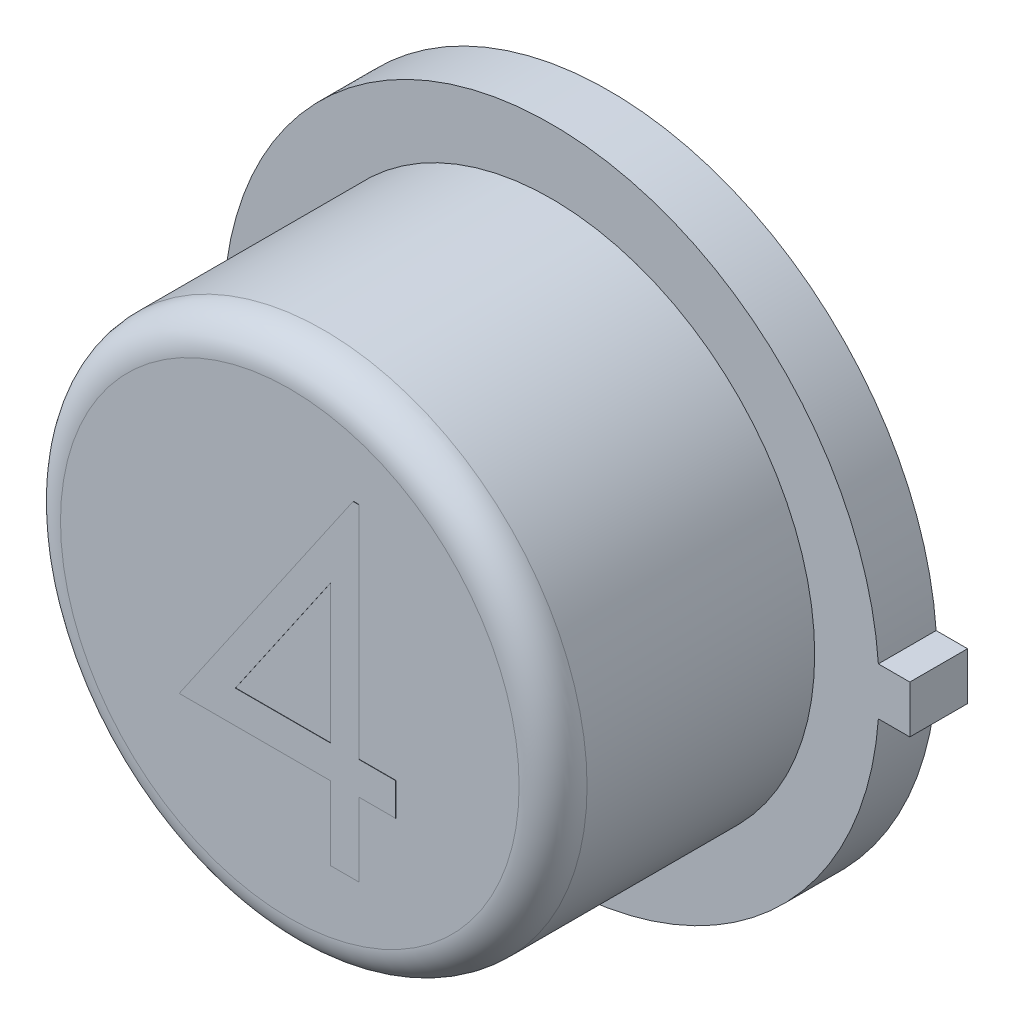
ISO-10303-21;
HEADER;
FILE_DESCRIPTION(('STEP AP214'),'2;1');
FILE_NAME('part.step','',(''),(''),'','','');
FILE_SCHEMA(('AUTOMOTIVE_DESIGN { 1 0 10303 214 1 1 1 1 }'));
ENDSEC;
DATA;
#1=APPLICATION_CONTEXT('core data for automotive mechanical design processes');
#2=APPLICATION_PROTOCOL_DEFINITION('international standard','automotive_design',2000,#1);
#3=PRODUCT_CONTEXT('',#1,'mechanical');
#4=PRODUCT('Part','Part','',(#3));
#5=PRODUCT_RELATED_PRODUCT_CATEGORY('part','',(#4));
#6=PRODUCT_DEFINITION_FORMATION('','',#4);
#7=PRODUCT_DEFINITION_CONTEXT('part definition',#1,'design');
#8=PRODUCT_DEFINITION('design','',#6,#7);
#9=PRODUCT_DEFINITION_SHAPE('','',#8);
#10=(LENGTH_UNIT() NAMED_UNIT(*) SI_UNIT(.MILLI.,.METRE.));
#11=(NAMED_UNIT(*) PLANE_ANGLE_UNIT() SI_UNIT($,.RADIAN.));
#12=(NAMED_UNIT(*) SI_UNIT($,.STERADIAN.) SOLID_ANGLE_UNIT());
#13=UNCERTAINTY_MEASURE_WITH_UNIT(LENGTH_MEASURE(1.E-05),#10,'distance_accuracy_value','');
#14=(GEOMETRIC_REPRESENTATION_CONTEXT(3) GLOBAL_UNCERTAINTY_ASSIGNED_CONTEXT((#13)) GLOBAL_UNIT_ASSIGNED_CONTEXT((#10,
#11,#12)) REPRESENTATION_CONTEXT('',''));
#15=CARTESIAN_POINT('',(0.,0.,0.));
#16=DIRECTION('',(0.,0.,1.));
#17=DIRECTION('',(1.,0.,0.));
#18=AXIS2_PLACEMENT_3D('',#15,#16,#17);
#19=CARTESIAN_POINT('',(0.,0.,2.3876));
#20=DIRECTION('',(0.,0.,1.));
#21=DIRECTION('',(1.,0.,0.));
#22=AXIS2_PLACEMENT_3D('',#19,#20,#21);
#23=PLANE('',#22);
#24=DIRECTION('',(0.566105543193208,0.824332768950697,0.));
#25=VECTOR('',#24,1.);
#26=CARTESIAN_POINT('',(-0.824278846153846,-0.6686219761522,2.3876));
#27=LINE('',#26,#25);
#28=CARTESIAN_POINT('',(-0.824278846153846,-0.6686219761522,2.3876));
#29=VERTEX_POINT('',#28);
#30=CARTESIAN_POINT('',(0.475582181490385,1.22416648538626,2.3876));
#31=VERTEX_POINT('',#30);
#32=EDGE_CURVE('E171',#29,#31,#27,.T.);
#33=ORIENTED_EDGE('',*,*,#32,.T.);
#34=DIRECTION('',(1.,0.,0.));
#35=VECTOR('',#34,1.);
#36=CARTESIAN_POINT('',(0.475582181490385,1.22416648538626,2.3876));
#37=LINE('',#36,#35);
#38=CARTESIAN_POINT('',(0.518990384615385,1.22416648538626,2.3876));
#39=VERTEX_POINT('',#38);
#40=EDGE_CURVE('E217',#31,#39,#37,.T.);
#41=ORIENTED_EDGE('',*,*,#40,.T.);
#42=DIRECTION('',(0.,-1.,0.));
#43=VECTOR('',#42,1.);
#44=CARTESIAN_POINT('',(0.518990384615385,1.22416648538626,2.3876));
#45=LINE('',#44,#43);
#46=CARTESIAN_POINT('',(0.518990384615385,-0.424391206921431,2.3876));
#47=VERTEX_POINT('',#46);
#48=EDGE_CURVE('E219',#39,#47,#45,.T.);
#49=ORIENTED_EDGE('',*,*,#48,.T.);
#50=DIRECTION('',(1.,0.,0.));
#51=VECTOR('',#50,1.);
#52=CARTESIAN_POINT('',(0.518990384615385,-0.424391206921431,2.3876));
#53=LINE('',#52,#51);
#54=CARTESIAN_POINT('',(0.79375,-0.424391206921431,2.3876));
#55=VERTEX_POINT('',#54);
#56=EDGE_CURVE('E221',#47,#55,#53,.T.);
#57=ORIENTED_EDGE('',*,*,#56,.T.);
#58=DIRECTION('',(0.,-1.,0.));
#59=VECTOR('',#58,1.);
#60=CARTESIAN_POINT('',(0.79375,-0.424391206921431,2.3876));
#61=LINE('',#60,#59);
#62=CARTESIAN_POINT('',(0.79375,-0.6686219761522,2.3876));
#63=VERTEX_POINT('',#62);
#64=EDGE_CURVE('E223',#55,#63,#61,.T.);
#65=ORIENTED_EDGE('',*,*,#64,.T.);
#66=DIRECTION('',(-1.,0.,0.));
#67=VECTOR('',#66,1.);
#68=CARTESIAN_POINT('',(0.79375,-0.6686219761522,2.3876));
#69=LINE('',#68,#67);
#70=CARTESIAN_POINT('',(0.518990384615385,-0.6686219761522,2.3876));
#71=VERTEX_POINT('',#70);
#72=EDGE_CURVE('E225',#63,#71,#69,.T.);
#73=ORIENTED_EDGE('',*,*,#72,.T.);
#74=DIRECTION('',(0.,-1.,0.));
#75=VECTOR('',#74,1.);
#76=CARTESIAN_POINT('',(0.518990384615385,-0.6686219761522,2.3876));
#77=LINE('',#76,#75);
#78=CARTESIAN_POINT('',(0.518990384615385,-1.21814120692143,2.3876));
#79=VERTEX_POINT('',#78);
#80=EDGE_CURVE('E227',#71,#79,#77,.T.);
#81=ORIENTED_EDGE('',*,*,#80,.T.);
#82=DIRECTION('',(-1.,0.,0.));
#83=VECTOR('',#82,1.);
#84=CARTESIAN_POINT('',(0.518990384615385,-1.21814120692143,2.3876));
#85=LINE('',#84,#83);
#86=CARTESIAN_POINT('',(0.305288461538462,-1.21814120692143,2.3876));
#87=VERTEX_POINT('',#86);
#88=EDGE_CURVE('E229',#79,#87,#85,.T.);
#89=ORIENTED_EDGE('',*,*,#88,.T.);
#90=DIRECTION('',(0.,1.,0.));
#91=VECTOR('',#90,1.);
#92=CARTESIAN_POINT('',(0.305288461538462,-1.21814120692143,2.3876));
#93=LINE('',#92,#91);
#94=CARTESIAN_POINT('',(0.305288461538462,-0.6686219761522,2.3876));
#95=VERTEX_POINT('',#94);
#96=EDGE_CURVE('E53',#87,#95,#93,.T.);
#97=ORIENTED_EDGE('',*,*,#96,.T.);
#98=DIRECTION('',(-1.,0.,0.));
#99=VECTOR('',#98,1.);
#100=CARTESIAN_POINT('',(0.305288461538462,-0.6686219761522,2.3876));
#101=LINE('',#100,#99);
#102=EDGE_CURVE('E48',#95,#29,#101,.T.);
#103=ORIENTED_EDGE('',*,*,#102,.T.);
#104=EDGE_LOOP('',(#33,#41,#49,#57,#65,#73,#81,#89,#97,#103));
#105=FACE_BOUND('',#104,.T.);
#106=CARTESIAN_POINT('',(0.,0.,2.3876));
#107=DIRECTION('',(0.,0.,1.));
#108=DIRECTION('',(1.,0.,0.));
#109=AXIS2_PLACEMENT_3D('',#106,#107,#108);
#110=CIRCLE('',#109,1.7145);
#111=CARTESIAN_POINT('',(1.7145,0.,2.3876));
#112=VERTEX_POINT('',#111);
#113=EDGE_CURVE('E41',#112,#112,#110,.T.);
#114=ORIENTED_EDGE('',*,*,#113,.T.);
#115=EDGE_LOOP('',(#114));
#116=FACE_BOUND('',#115,.T.);
#117=ADVANCED_FACE('F33',(#105,#116),#23,.T.);
#118=CARTESIAN_POINT('',(-0.00322860507148085,-5.53029106093277,0.));
#119=DIRECTION('',(0.,0.,1.));
#120=DIRECTION('',(1.,0.,0.));
#121=AXIS2_PLACEMENT_3D('',#118,#119,#120);
#122=PLANE('',#121);
#123=DIRECTION('',(1.,0.,0.));
#124=VECTOR('',#123,1.);
#125=CARTESIAN_POINT('',(-0.0032286050714822,0.177799999999999,0.));
#126=LINE('',#125,#124);
#127=CARTESIAN_POINT('',(2.44464278985704,0.177799999999999,0.));
#128=VERTEX_POINT('',#127);
#129=CARTESIAN_POINT('',(2.6797,0.177799999999999,0.));
#130=VERTEX_POINT('',#129);
#131=EDGE_CURVE('E266',#128,#130,#126,.T.);
#132=ORIENTED_EDGE('',*,*,#131,.T.);
#133=DIRECTION('',(0.,-1.,0.));
#134=VECTOR('',#133,1.);
#135=CARTESIAN_POINT('',(2.6797,-5.53029106093277,0.));
#136=LINE('',#135,#134);
#137=CARTESIAN_POINT('',(2.6797,-0.1778,0.));
#138=VERTEX_POINT('',#137);
#139=EDGE_CURVE('E271',#130,#138,#136,.T.);
#140=ORIENTED_EDGE('',*,*,#139,.T.);
#141=DIRECTION('',(-1.,0.,0.));
#142=VECTOR('',#141,1.);
#143=CARTESIAN_POINT('',(-0.00322860507148085,-0.1778,0.));
#144=LINE('',#143,#142);
#145=CARTESIAN_POINT('',(2.44464278985704,-0.1778,0.));
#146=VERTEX_POINT('',#145);
#147=EDGE_CURVE('E285',#138,#146,#144,.T.);
#148=ORIENTED_EDGE('',*,*,#147,.T.);
#149=CARTESIAN_POINT('',(0.,0.,0.));
#150=DIRECTION('',(0.,0.,1.));
#151=DIRECTION('',(1.,0.,0.));
#152=AXIS2_PLACEMENT_3D('',#149,#150,#151);
#153=CIRCLE('',#152,2.4511);
#154=EDGE_CURVE('E282',#128,#146,#153,.T.);
#155=ORIENTED_EDGE('',*,*,#154,.F.);
#156=EDGE_LOOP('',(#132,#140,#148,#155));
#157=FACE_BOUND('',#156,.T.);
#158=CARTESIAN_POINT('',(0.,0.,0.));
#159=DIRECTION('',(0.,0.,1.));
#160=DIRECTION('',(1.,0.,0.));
#161=AXIS2_PLACEMENT_3D('',#158,#159,#160);
#162=CIRCLE('',#161,1.75756648099992);
#163=CARTESIAN_POINT('',(1.75756648099992,0.,0.));
#164=VERTEX_POINT('',#163);
#165=EDGE_CURVE('E297',#164,#164,#162,.F.);
#166=ORIENTED_EDGE('',*,*,#165,.F.);
#167=EDGE_LOOP('',(#166));
#168=FACE_BOUND('',#167,.T.);
#169=ADVANCED_FACE('F318',(#157,#168),#122,.F.);
#170=CARTESIAN_POINT('',(-0.00322860507148085,-5.53029106093277,0.4318));
#171=DIRECTION('',(0.,0.,1.));
#172=DIRECTION('',(1.,0.,0.));
#173=AXIS2_PLACEMENT_3D('',#170,#171,#172);
#174=PLANE('',#173);
#175=DIRECTION('',(1.,0.,0.));
#176=VECTOR('',#175,1.);
#177=CARTESIAN_POINT('',(-0.0032286050714822,0.177799999999999,0.4318));
#178=LINE('',#177,#176);
#179=CARTESIAN_POINT('',(2.44464278985704,0.177799999999999,0.4318));
#180=VERTEX_POINT('',#179);
#181=CARTESIAN_POINT('',(2.6797,0.177799999999999,0.4318));
#182=VERTEX_POINT('',#181);
#183=EDGE_CURVE('E267',#180,#182,#178,.T.);
#184=ORIENTED_EDGE('',*,*,#183,.F.);
#185=CARTESIAN_POINT('',(0.,0.,0.4318));
#186=DIRECTION('',(0.,0.,1.));
#187=DIRECTION('',(1.,0.,0.));
#188=AXIS2_PLACEMENT_3D('',#185,#186,#187);
#189=CIRCLE('',#188,2.4511);
#190=CARTESIAN_POINT('',(2.44464278985704,-0.1778,0.4318));
#191=VERTEX_POINT('',#190);
#192=EDGE_CURVE('E270',#180,#191,#189,.T.);
#193=ORIENTED_EDGE('',*,*,#192,.T.);
#194=DIRECTION('',(-1.,0.,0.));
#195=VECTOR('',#194,1.);
#196=CARTESIAN_POINT('',(-0.00322860507148085,-0.1778,0.4318));
#197=LINE('',#196,#195);
#198=CARTESIAN_POINT('',(2.6797,-0.1778,0.4318));
#199=VERTEX_POINT('',#198);
#200=EDGE_CURVE('E273',#199,#191,#197,.T.);
#201=ORIENTED_EDGE('',*,*,#200,.F.);
#202=DIRECTION('',(0.,-1.,0.));
#203=VECTOR('',#202,1.);
#204=CARTESIAN_POINT('',(2.6797,-5.53029106093277,0.4318));
#205=LINE('',#204,#203);
#206=EDGE_CURVE('E276',#182,#199,#205,.T.);
#207=ORIENTED_EDGE('',*,*,#206,.F.);
#208=EDGE_LOOP('',(#184,#193,#201,#207));
#209=FACE_BOUND('',#208,.T.);
#210=CARTESIAN_POINT('',(0.,0.,0.4318));
#211=DIRECTION('',(0.,0.,1.));
#212=DIRECTION('',(1.,0.,0.));
#213=AXIS2_PLACEMENT_3D('',#210,#211,#212);
#214=CIRCLE('',#213,1.9685);
#215=CARTESIAN_POINT('',(1.9685,0.,0.4318));
#216=VERTEX_POINT('',#215);
#217=EDGE_CURVE('E263',#216,#216,#214,.T.);
#218=ORIENTED_EDGE('',*,*,#217,.F.);
#219=EDGE_LOOP('',(#218));
#220=FACE_BOUND('',#219,.T.);
#221=ADVANCED_FACE('F324',(#209,#220),#174,.T.);
#222=CARTESIAN_POINT('',(-0.0032286050714822,0.177799999999999,0.4318));
#223=DIRECTION('',(0.,1.,0.));
#224=DIRECTION('',(-1.,0.,0.));
#225=AXIS2_PLACEMENT_3D('',#222,#223,#224);
#226=PLANE('',#225);
#227=ORIENTED_EDGE('',*,*,#131,.F.);
#228=DIRECTION('',(0.,0.,-1.));
#229=VECTOR('',#228,1.);
#230=CARTESIAN_POINT('',(2.44464278985704,0.177799999999999,0.4318));
#231=LINE('',#230,#229);
#232=EDGE_CURVE('E295',#180,#128,#231,.T.);
#233=ORIENTED_EDGE('',*,*,#232,.F.);
#234=ORIENTED_EDGE('',*,*,#183,.T.);
#235=DIRECTION('',(0.,0.,-1.));
#236=VECTOR('',#235,1.);
#237=CARTESIAN_POINT('',(2.6797,0.177799999999999,0.4318));
#238=LINE('',#237,#236);
#239=EDGE_CURVE('E279',#182,#130,#238,.T.);
#240=ORIENTED_EDGE('',*,*,#239,.T.);
#241=EDGE_LOOP('',(#227,#233,#234,#240));
#242=FACE_BOUND('',#241,.T.);
#243=ADVANCED_FACE('F404',(#242),#226,.T.);
#244=CARTESIAN_POINT('',(0.,0.,0.4318));
#245=DIRECTION('',(0.,0.,-1.));
#246=DIRECTION('',(-1.,0.,0.));
#247=AXIS2_PLACEMENT_3D('',#244,#245,#246);
#248=CYLINDRICAL_SURFACE('',#247,2.4511);
#249=ORIENTED_EDGE('',*,*,#154,.T.);
#250=DIRECTION('',(0.,0.,-1.));
#251=VECTOR('',#250,1.);
#252=CARTESIAN_POINT('',(2.44464278985704,-0.1778,0.4318));
#253=LINE('',#252,#251);
#254=EDGE_CURVE('E293',#191,#146,#253,.T.);
#255=ORIENTED_EDGE('',*,*,#254,.F.);
#256=ORIENTED_EDGE('',*,*,#192,.F.);
#257=ORIENTED_EDGE('',*,*,#232,.T.);
#258=EDGE_LOOP('',(#249,#255,#256,#257));
#259=FACE_BOUND('',#258,.T.);
#260=ADVANCED_FACE('F409',(#259),#248,.T.);
#261=CARTESIAN_POINT('',(-0.00322860507148085,-0.1778,0.4318));
#262=DIRECTION('',(0.,-1.,0.));
#263=DIRECTION('',(0.,0.,-1.));
#264=AXIS2_PLACEMENT_3D('',#261,#262,#263);
#265=PLANE('',#264);
#266=ORIENTED_EDGE('',*,*,#147,.F.);
#267=DIRECTION('',(0.,0.,-1.));
#268=VECTOR('',#267,1.);
#269=CARTESIAN_POINT('',(2.6797,-0.1778,0.4318));
#270=LINE('',#269,#268);
#271=EDGE_CURVE('E291',#199,#138,#270,.T.);
#272=ORIENTED_EDGE('',*,*,#271,.F.);
#273=ORIENTED_EDGE('',*,*,#200,.T.);
#274=ORIENTED_EDGE('',*,*,#254,.T.);
#275=EDGE_LOOP('',(#266,#272,#273,#274));
#276=FACE_BOUND('',#275,.T.);
#277=ADVANCED_FACE('F398',(#276),#265,.T.);
#278=CARTESIAN_POINT('',(2.6797,-5.53029106093277,0.4318));
#279=DIRECTION('',(1.,0.,0.));
#280=DIRECTION('',(0.,0.,-1.));
#281=AXIS2_PLACEMENT_3D('',#278,#279,#280);
#282=PLANE('',#281);
#283=ORIENTED_EDGE('',*,*,#139,.F.);
#284=ORIENTED_EDGE('',*,*,#239,.F.);
#285=ORIENTED_EDGE('',*,*,#206,.T.);
#286=ORIENTED_EDGE('',*,*,#271,.T.);
#287=EDGE_LOOP('',(#283,#284,#285,#286));
#288=FACE_BOUND('',#287,.T.);
#289=ADVANCED_FACE('F389',(#288),#282,.T.);
#290=CARTESIAN_POINT('',(0.,0.,2.3876));
#291=DIRECTION('',(0.,0.,-1.));
#292=DIRECTION('',(-1.,0.,0.));
#293=AXIS2_PLACEMENT_3D('',#290,#291,#292);
#294=CYLINDRICAL_SURFACE('',#293,1.9685);
#295=CARTESIAN_POINT('',(0.,0.,2.1336));
#296=DIRECTION('',(0.,0.,1.));
#297=DIRECTION('',(1.,0.,0.));
#298=AXIS2_PLACEMENT_3D('',#295,#296,#297);
#299=CIRCLE('',#298,1.9685);
#300=CARTESIAN_POINT('',(1.9685,0.,2.1336));
#301=VERTEX_POINT('',#300);
#302=EDGE_CURVE('E11',#301,#301,#299,.F.);
#303=ORIENTED_EDGE('',*,*,#302,.T.);
#304=EDGE_LOOP('',(#303));
#305=FACE_BOUND('',#304,.T.);
#306=ORIENTED_EDGE('',*,*,#217,.T.);
#307=EDGE_LOOP('',(#306));
#308=FACE_BOUND('',#307,.T.);
#309=ADVANCED_FACE('F384',(#305,#308),#294,.T.);
#310=CARTESIAN_POINT('',(0.,0.,-0.00254));
#311=DIRECTION('',(0.,0.,1.));
#312=DIRECTION('',(1.,0.,0.));
#313=AXIS2_PLACEMENT_3D('',#310,#311,#312);
#314=CYLINDRICAL_SURFACE('',#313,1.75756648099992);
#315=CARTESIAN_POINT('',(0.,0.,-0.00254));
#316=DIRECTION('',(0.,0.,-1.));
#317=DIRECTION('',(-1.,0.,0.));
#318=AXIS2_PLACEMENT_3D('',#315,#316,#317);
#319=CIRCLE('',#318,1.75756648099992);
#320=CARTESIAN_POINT('',(-1.75756648099992,0.,-0.00254));
#321=VERTEX_POINT('',#320);
#322=EDGE_CURVE('E235',#321,#321,#319,.T.);
#323=ORIENTED_EDGE('',*,*,#322,.F.);
#324=EDGE_LOOP('',(#323));
#325=FACE_BOUND('',#324,.T.);
#326=ORIENTED_EDGE('',*,*,#165,.T.);
#327=EDGE_LOOP('',(#326));
#328=FACE_BOUND('',#327,.T.);
#329=ADVANCED_FACE('F313',(#325,#328),#314,.T.);
#330=CARTESIAN_POINT('',(0.,0.,-0.00254));
#331=DIRECTION('',(0.,0.,-1.));
#332=DIRECTION('',(-1.,0.,0.));
#333=AXIS2_PLACEMENT_3D('',#330,#331,#332);
#334=PLANE('',#333);
#335=ORIENTED_EDGE('',*,*,#322,.T.);
#336=EDGE_LOOP('',(#335));
#337=FACE_BOUND('',#336,.T.);
#338=ADVANCED_FACE('F304',(#337),#334,.T.);
#339=CARTESIAN_POINT('',(0.,0.,2.1336));
#340=DIRECTION('',(0.,0.,1.));
#341=DIRECTION('',(1.,0.,0.));
#342=AXIS2_PLACEMENT_3D('',#339,#340,#341);
#343=TOROIDAL_SURFACE('',#342,1.7145,0.254);
#344=ORIENTED_EDGE('',*,*,#302,.F.);
#345=EDGE_LOOP('',(#344));
#346=FACE_BOUND('',#345,.T.);
#347=ORIENTED_EDGE('',*,*,#113,.F.);
#348=EDGE_LOOP('',(#347));
#349=FACE_BOUND('',#348,.T.);
#350=ADVANCED_FACE('F35',(#346,#349),#343,.T.);
#351=CARTESIAN_POINT('',(0.475582181490385,1.22416648538626,2.39014));
#352=DIRECTION('',(0.,0.,-1.));
#353=DIRECTION('',(-1.,0.,0.));
#354=AXIS2_PLACEMENT_3D('',#351,#352,#353);
#355=PLANE('',#354);
#356=DIRECTION('',(0.566105543193208,0.824332768950697,0.));
#357=VECTOR('',#356,1.);
#358=CARTESIAN_POINT('',(-0.824278846153846,-0.6686219761522,2.39014));
#359=LINE('',#358,#357);
#360=CARTESIAN_POINT('',(-0.824278846153846,-0.6686219761522,2.39014));
#361=VERTEX_POINT('',#360);
#362=CARTESIAN_POINT('',(0.475582181490385,1.22416648538626,2.39014));
#363=VERTEX_POINT('',#362);
#364=EDGE_CURVE('E185',#361,#363,#359,.T.);
#365=ORIENTED_EDGE('',*,*,#364,.F.);
#366=DIRECTION('',(-1.,0.,0.));
#367=VECTOR('',#366,1.);
#368=CARTESIAN_POINT('',(0.305288461538462,-0.6686219761522,2.39014));
#369=LINE('',#368,#367);
#370=CARTESIAN_POINT('',(0.305288461538462,-0.6686219761522,2.39014));
#371=VERTEX_POINT('',#370);
#372=EDGE_CURVE('E212',#371,#361,#369,.T.);
#373=ORIENTED_EDGE('',*,*,#372,.F.);
#374=DIRECTION('',(0.,1.,0.));
#375=VECTOR('',#374,1.);
#376=CARTESIAN_POINT('',(0.305288461538462,-1.21814120692143,2.39014));
#377=LINE('',#376,#375);
#378=CARTESIAN_POINT('',(0.305288461538462,-1.21814120692143,2.39014));
#379=VERTEX_POINT('',#378);
#380=EDGE_CURVE('E209',#379,#371,#377,.T.);
#381=ORIENTED_EDGE('',*,*,#380,.F.);
#382=DIRECTION('',(-1.,0.,0.));
#383=VECTOR('',#382,1.);
#384=CARTESIAN_POINT('',(0.518990384615385,-1.21814120692143,2.39014));
#385=LINE('',#384,#383);
#386=CARTESIAN_POINT('',(0.518990384615385,-1.21814120692143,2.39014));
#387=VERTEX_POINT('',#386);
#388=EDGE_CURVE('E206',#387,#379,#385,.T.);
#389=ORIENTED_EDGE('',*,*,#388,.F.);
#390=DIRECTION('',(0.,-1.,0.));
#391=VECTOR('',#390,1.);
#392=CARTESIAN_POINT('',(0.518990384615385,-0.6686219761522,2.39014));
#393=LINE('',#392,#391);
#394=CARTESIAN_POINT('',(0.518990384615385,-0.6686219761522,2.39014));
#395=VERTEX_POINT('',#394);
#396=EDGE_CURVE('E203',#395,#387,#393,.T.);
#397=ORIENTED_EDGE('',*,*,#396,.F.);
#398=DIRECTION('',(-1.,0.,0.));
#399=VECTOR('',#398,1.);
#400=CARTESIAN_POINT('',(0.79375,-0.6686219761522,2.39014));
#401=LINE('',#400,#399);
#402=CARTESIAN_POINT('',(0.79375,-0.6686219761522,2.39014));
#403=VERTEX_POINT('',#402);
#404=EDGE_CURVE('E200',#403,#395,#401,.T.);
#405=ORIENTED_EDGE('',*,*,#404,.F.);
#406=DIRECTION('',(0.,-1.,0.));
#407=VECTOR('',#406,1.);
#408=CARTESIAN_POINT('',(0.79375,-0.424391206921431,2.39014));
#409=LINE('',#408,#407);
#410=CARTESIAN_POINT('',(0.79375,-0.424391206921431,2.39014));
#411=VERTEX_POINT('',#410);
#412=EDGE_CURVE('E197',#411,#403,#409,.T.);
#413=ORIENTED_EDGE('',*,*,#412,.F.);
#414=DIRECTION('',(1.,0.,0.));
#415=VECTOR('',#414,1.);
#416=CARTESIAN_POINT('',(0.518990384615385,-0.424391206921431,2.39014));
#417=LINE('',#416,#415);
#418=CARTESIAN_POINT('',(0.518990384615385,-0.424391206921431,2.39014));
#419=VERTEX_POINT('',#418);
#420=EDGE_CURVE('E194',#419,#411,#417,.T.);
#421=ORIENTED_EDGE('',*,*,#420,.F.);
#422=DIRECTION('',(0.,-1.,0.));
#423=VECTOR('',#422,1.);
#424=CARTESIAN_POINT('',(0.518990384615385,1.22416648538626,2.39014));
#425=LINE('',#424,#423);
#426=CARTESIAN_POINT('',(0.518990384615385,1.22416648538626,2.39014));
#427=VERTEX_POINT('',#426);
#428=EDGE_CURVE('E191',#427,#419,#425,.T.);
#429=ORIENTED_EDGE('',*,*,#428,.F.);
#430=DIRECTION('',(1.,0.,0.));
#431=VECTOR('',#430,1.);
#432=CARTESIAN_POINT('',(0.475582181490385,1.22416648538626,2.39014));
#433=LINE('',#432,#431);
#434=EDGE_CURVE('E188',#363,#427,#433,.T.);
#435=ORIENTED_EDGE('',*,*,#434,.F.);
#436=EDGE_LOOP('',(#365,#373,#381,#389,#397,#405,#413,#421,#429,#435));
#437=FACE_BOUND('',#436,.T.);
#438=DIRECTION('',(1.,0.,0.));
#439=VECTOR('',#438,1.);
#440=CARTESIAN_POINT('',(-0.404507211538461,-0.424391206921431,2.39014));
#441=LINE('',#440,#439);
#442=CARTESIAN_POINT('',(-0.404507211538461,-0.424391206921431,2.39014));
#443=VERTEX_POINT('',#442);
#444=CARTESIAN_POINT('',(0.305288461538462,-0.424391206921431,2.39014));
#445=VERTEX_POINT('',#444);
#446=EDGE_CURVE('E152',#443,#445,#441,.T.);
#447=ORIENTED_EDGE('',*,*,#446,.F.);
#448=DIRECTION('',(-0.565883050718714,-0.82448552013318,0.));
#449=VECTOR('',#448,1.);
#450=CARTESIAN_POINT('',(0.305288461538462,0.609773456540108,2.39014));
#451=LINE('',#450,#449);
#452=CARTESIAN_POINT('',(0.305288461538462,0.609773456540108,2.39014));
#453=VERTEX_POINT('',#452);
#454=EDGE_CURVE('E175',#453,#443,#451,.T.);
#455=ORIENTED_EDGE('',*,*,#454,.F.);
#456=DIRECTION('',(0.,1.,0.));
#457=VECTOR('',#456,1.);
#458=CARTESIAN_POINT('',(0.305288461538462,-0.424391206921431,2.39014));
#459=LINE('',#458,#457);
#460=EDGE_CURVE('E162',#445,#453,#459,.T.);
#461=ORIENTED_EDGE('',*,*,#460,.F.);
#462=EDGE_LOOP('',(#447,#455,#461));
#463=FACE_BOUND('',#462,.T.);
#464=ADVANCED_FACE('F174',(#437,#463),#355,.F.);
#465=CARTESIAN_POINT('',(-0.824278846153846,-0.6686219761522,2.39014));
#466=DIRECTION('',(-0.824332768950697,0.566105543193208,0.));
#467=DIRECTION('',(-0.566105543193208,-0.824332768950697,0.));
#468=AXIS2_PLACEMENT_3D('',#465,#466,#467);
#469=PLANE('',#468);
#470=ORIENTED_EDGE('',*,*,#32,.F.);
#471=DIRECTION('',(0.,0.,-1.));
#472=VECTOR('',#471,1.);
#473=CARTESIAN_POINT('',(-0.824278846153846,-0.6686219761522,2.39014));
#474=LINE('',#473,#472);
#475=EDGE_CURVE('E233',#361,#29,#474,.T.);
#476=ORIENTED_EDGE('',*,*,#475,.F.);
#477=ORIENTED_EDGE('',*,*,#364,.T.);
#478=DIRECTION('',(0.,0.,-1.));
#479=VECTOR('',#478,1.);
#480=CARTESIAN_POINT('',(0.475582181490385,1.22416648538626,2.39014));
#481=LINE('',#480,#479);
#482=EDGE_CURVE('E215',#363,#31,#481,.T.);
#483=ORIENTED_EDGE('',*,*,#482,.T.);
#484=EDGE_LOOP('',(#470,#476,#477,#483));
#485=FACE_BOUND('',#484,.T.);
#486=ADVANCED_FACE('F310',(#485),#469,.T.);
#487=CARTESIAN_POINT('',(0.305288461538462,-0.6686219761522,2.39014));
#488=DIRECTION('',(0.,-1.,0.));
#489=DIRECTION('',(0.,0.,-1.));
#490=AXIS2_PLACEMENT_3D('',#487,#488,#489);
#491=PLANE('',#490);
#492=ORIENTED_EDGE('',*,*,#102,.F.);
#493=DIRECTION('',(0.,0.,-1.));
#494=VECTOR('',#493,1.);
#495=CARTESIAN_POINT('',(0.305288461538462,-0.6686219761522,2.39014));
#496=LINE('',#495,#494);
#497=EDGE_CURVE('E236',#371,#95,#496,.T.);
#498=ORIENTED_EDGE('',*,*,#497,.F.);
#499=ORIENTED_EDGE('',*,*,#372,.T.);
#500=ORIENTED_EDGE('',*,*,#475,.T.);
#501=EDGE_LOOP('',(#492,#498,#499,#500));
#502=FACE_BOUND('',#501,.T.);
#503=ADVANCED_FACE('F346',(#502),#491,.T.);
#504=CARTESIAN_POINT('',(0.305288461538462,-1.21814120692143,2.39014));
#505=DIRECTION('',(-1.,0.,0.));
#506=DIRECTION('',(0.,0.,1.));
#507=AXIS2_PLACEMENT_3D('',#504,#505,#506);
#508=PLANE('',#507);
#509=ORIENTED_EDGE('',*,*,#96,.F.);
#510=DIRECTION('',(0.,0.,-1.));
#511=VECTOR('',#510,1.);
#512=CARTESIAN_POINT('',(0.305288461538462,-1.21814120692143,2.39014));
#513=LINE('',#512,#511);
#514=EDGE_CURVE('E238',#379,#87,#513,.T.);
#515=ORIENTED_EDGE('',*,*,#514,.F.);
#516=ORIENTED_EDGE('',*,*,#380,.T.);
#517=ORIENTED_EDGE('',*,*,#497,.T.);
#518=EDGE_LOOP('',(#509,#515,#516,#517));
#519=FACE_BOUND('',#518,.T.);
#520=ADVANCED_FACE('F349',(#519),#508,.T.);
#521=CARTESIAN_POINT('',(0.518990384615385,-1.21814120692143,2.39014));
#522=DIRECTION('',(0.,-1.,0.));
#523=DIRECTION('',(0.,0.,-1.));
#524=AXIS2_PLACEMENT_3D('',#521,#522,#523);
#525=PLANE('',#524);
#526=ORIENTED_EDGE('',*,*,#88,.F.);
#527=DIRECTION('',(0.,0.,-1.));
#528=VECTOR('',#527,1.);
#529=CARTESIAN_POINT('',(0.518990384615385,-1.21814120692143,2.39014));
#530=LINE('',#529,#528);
#531=EDGE_CURVE('E241',#387,#79,#530,.T.);
#532=ORIENTED_EDGE('',*,*,#531,.F.);
#533=ORIENTED_EDGE('',*,*,#388,.T.);
#534=ORIENTED_EDGE('',*,*,#514,.T.);
#535=EDGE_LOOP('',(#526,#532,#533,#534));
#536=FACE_BOUND('',#535,.T.);
#537=ADVANCED_FACE('F353',(#536),#525,.T.);
#538=CARTESIAN_POINT('',(0.518990384615385,-0.6686219761522,2.39014));
#539=DIRECTION('',(1.,0.,0.));
#540=DIRECTION('',(0.,0.,-1.));
#541=AXIS2_PLACEMENT_3D('',#538,#539,#540);
#542=PLANE('',#541);
#543=ORIENTED_EDGE('',*,*,#80,.F.);
#544=DIRECTION('',(0.,0.,-1.));
#545=VECTOR('',#544,1.);
#546=CARTESIAN_POINT('',(0.518990384615385,-0.6686219761522,2.39014));
#547=LINE('',#546,#545);
#548=EDGE_CURVE('E244',#395,#71,#547,.T.);
#549=ORIENTED_EDGE('',*,*,#548,.F.);
#550=ORIENTED_EDGE('',*,*,#396,.T.);
#551=ORIENTED_EDGE('',*,*,#531,.T.);
#552=EDGE_LOOP('',(#543,#549,#550,#551));
#553=FACE_BOUND('',#552,.T.);
#554=ADVANCED_FACE('F357',(#553),#542,.T.);
#555=CARTESIAN_POINT('',(0.79375,-0.6686219761522,2.39014));
#556=DIRECTION('',(0.,-1.,0.));
#557=DIRECTION('',(0.,0.,-1.));
#558=AXIS2_PLACEMENT_3D('',#555,#556,#557);
#559=PLANE('',#558);
#560=ORIENTED_EDGE('',*,*,#72,.F.);
#561=DIRECTION('',(0.,0.,-1.));
#562=VECTOR('',#561,1.);
#563=CARTESIAN_POINT('',(0.79375,-0.6686219761522,2.39014));
#564=LINE('',#563,#562);
#565=EDGE_CURVE('E247',#403,#63,#564,.T.);
#566=ORIENTED_EDGE('',*,*,#565,.F.);
#567=ORIENTED_EDGE('',*,*,#404,.T.);
#568=ORIENTED_EDGE('',*,*,#548,.T.);
#569=EDGE_LOOP('',(#560,#566,#567,#568));
#570=FACE_BOUND('',#569,.T.);
#571=ADVANCED_FACE('F361',(#570),#559,.T.);
#572=CARTESIAN_POINT('',(0.79375,-0.424391206921431,2.39014));
#573=DIRECTION('',(1.,0.,0.));
#574=DIRECTION('',(0.,0.,-1.));
#575=AXIS2_PLACEMENT_3D('',#572,#573,#574);
#576=PLANE('',#575);
#577=ORIENTED_EDGE('',*,*,#64,.F.);
#578=DIRECTION('',(0.,0.,-1.));
#579=VECTOR('',#578,1.);
#580=CARTESIAN_POINT('',(0.79375,-0.424391206921431,2.39014));
#581=LINE('',#580,#579);
#582=EDGE_CURVE('E250',#411,#55,#581,.T.);
#583=ORIENTED_EDGE('',*,*,#582,.F.);
#584=ORIENTED_EDGE('',*,*,#412,.T.);
#585=ORIENTED_EDGE('',*,*,#565,.T.);
#586=EDGE_LOOP('',(#577,#583,#584,#585));
#587=FACE_BOUND('',#586,.T.);
#588=ADVANCED_FACE('F365',(#587),#576,.T.);
#589=CARTESIAN_POINT('',(0.518990384615385,-0.424391206921431,2.39014));
#590=DIRECTION('',(0.,1.,0.));
#591=DIRECTION('',(0.,0.,1.));
#592=AXIS2_PLACEMENT_3D('',#589,#590,#591);
#593=PLANE('',#592);
#594=ORIENTED_EDGE('',*,*,#56,.F.);
#595=DIRECTION('',(0.,0.,-1.));
#596=VECTOR('',#595,1.);
#597=CARTESIAN_POINT('',(0.518990384615385,-0.424391206921431,2.39014));
#598=LINE('',#597,#596);
#599=EDGE_CURVE('E253',#419,#47,#598,.T.);
#600=ORIENTED_EDGE('',*,*,#599,.F.);
#601=ORIENTED_EDGE('',*,*,#420,.T.);
#602=ORIENTED_EDGE('',*,*,#582,.T.);
#603=EDGE_LOOP('',(#594,#600,#601,#602));
#604=FACE_BOUND('',#603,.T.);
#605=ADVANCED_FACE('F369',(#604),#593,.T.);
#606=CARTESIAN_POINT('',(0.518990384615385,1.22416648538626,2.39014));
#607=DIRECTION('',(1.,0.,0.));
#608=DIRECTION('',(0.,0.,-1.));
#609=AXIS2_PLACEMENT_3D('',#606,#607,#608);
#610=PLANE('',#609);
#611=ORIENTED_EDGE('',*,*,#48,.F.);
#612=DIRECTION('',(0.,0.,-1.));
#613=VECTOR('',#612,1.);
#614=CARTESIAN_POINT('',(0.518990384615385,1.22416648538626,2.39014));
#615=LINE('',#614,#613);
#616=EDGE_CURVE('E256',#427,#39,#615,.T.);
#617=ORIENTED_EDGE('',*,*,#616,.F.);
#618=ORIENTED_EDGE('',*,*,#428,.T.);
#619=ORIENTED_EDGE('',*,*,#599,.T.);
#620=EDGE_LOOP('',(#611,#617,#618,#619));
#621=FACE_BOUND('',#620,.T.);
#622=ADVANCED_FACE('F373',(#621),#610,.T.);
#623=CARTESIAN_POINT('',(0.475582181490385,1.22416648538626,2.39014));
#624=DIRECTION('',(0.,1.,0.));
#625=DIRECTION('',(0.,0.,1.));
#626=AXIS2_PLACEMENT_3D('',#623,#624,#625);
#627=PLANE('',#626);
#628=ORIENTED_EDGE('',*,*,#40,.F.);
#629=ORIENTED_EDGE('',*,*,#482,.F.);
#630=ORIENTED_EDGE('',*,*,#434,.T.);
#631=ORIENTED_EDGE('',*,*,#616,.T.);
#632=EDGE_LOOP('',(#628,#629,#630,#631));
#633=FACE_BOUND('',#632,.T.);
#634=ADVANCED_FACE('F344',(#633),#627,.T.);
#635=CARTESIAN_POINT('',(-0.404507211538461,-0.424391206921431,2.39014));
#636=DIRECTION('',(0.,1.,0.));
#637=DIRECTION('',(0.,0.,1.));
#638=AXIS2_PLACEMENT_3D('',#635,#636,#637);
#639=PLANE('',#638);
#640=DIRECTION('',(1.,0.,0.));
#641=VECTOR('',#640,1.);
#642=CARTESIAN_POINT('',(-0.404507211538461,-0.424391206921431,2.3876));
#643=LINE('',#642,#641);
#644=CARTESIAN_POINT('',(-0.404507211538461,-0.424391206921431,2.3876));
#645=VERTEX_POINT('',#644);
#646=CARTESIAN_POINT('',(0.305288461538462,-0.424391206921431,2.3876));
#647=VERTEX_POINT('',#646);
#648=EDGE_CURVE('E179',#645,#647,#643,.T.);
#649=ORIENTED_EDGE('',*,*,#648,.F.);
#650=DIRECTION('',(0.,0.,-1.));
#651=VECTOR('',#650,1.);
#652=CARTESIAN_POINT('',(-0.404507211538461,-0.424391206921431,2.39014));
#653=LINE('',#652,#651);
#654=EDGE_CURVE('E158',#443,#645,#653,.T.);
#655=ORIENTED_EDGE('',*,*,#654,.F.);
#656=ORIENTED_EDGE('',*,*,#446,.T.);
#657=DIRECTION('',(0.,0.,-1.));
#658=VECTOR('',#657,1.);
#659=CARTESIAN_POINT('',(0.305288461538462,-0.424391206921431,2.39014));
#660=LINE('',#659,#658);
#661=EDGE_CURVE('E156',#445,#647,#660,.T.);
#662=ORIENTED_EDGE('',*,*,#661,.T.);
#663=EDGE_LOOP('',(#649,#655,#656,#662));
#664=FACE_BOUND('',#663,.T.);
#665=ADVANCED_FACE('F155',(#664),#639,.T.);
#666=CARTESIAN_POINT('',(0.305288461538462,-0.424391206921431,2.39014));
#667=DIRECTION('',(-1.,0.,0.));
#668=DIRECTION('',(0.,0.,1.));
#669=AXIS2_PLACEMENT_3D('',#666,#667,#668);
#670=PLANE('',#669);
#671=DIRECTION('',(0.,1.,0.));
#672=VECTOR('',#671,1.);
#673=CARTESIAN_POINT('',(0.305288461538462,-0.424391206921431,2.3876));
#674=LINE('',#673,#672);
#675=CARTESIAN_POINT('',(0.305288461538462,0.609773456540108,2.3876));
#676=VERTEX_POINT('',#675);
#677=EDGE_CURVE('E170',#647,#676,#674,.T.);
#678=ORIENTED_EDGE('',*,*,#677,.F.);
#679=ORIENTED_EDGE('',*,*,#661,.F.);
#680=ORIENTED_EDGE('',*,*,#460,.T.);
#681=DIRECTION('',(0.,0.,-1.));
#682=VECTOR('',#681,1.);
#683=CARTESIAN_POINT('',(0.305288461538462,0.609773456540108,2.39014));
#684=LINE('',#683,#682);
#685=EDGE_CURVE('E172',#453,#676,#684,.T.);
#686=ORIENTED_EDGE('',*,*,#685,.T.);
#687=EDGE_LOOP('',(#678,#679,#680,#686));
#688=FACE_BOUND('',#687,.T.);
#689=ADVANCED_FACE('F168',(#688),#670,.T.);
#690=CARTESIAN_POINT('',(0.305288461538462,0.609773456540108,2.39014));
#691=DIRECTION('',(0.82448552013318,-0.565883050718714,0.));
#692=DIRECTION('',(0.565883050718714,0.82448552013318,0.));
#693=AXIS2_PLACEMENT_3D('',#690,#691,#692);
#694=PLANE('',#693);
#695=DIRECTION('',(-0.565883050718714,-0.82448552013318,0.));
#696=VECTOR('',#695,1.);
#697=CARTESIAN_POINT('',(0.305288461538462,0.609773456540108,2.3876));
#698=LINE('',#697,#696);
#699=EDGE_CURVE('E163',#676,#645,#698,.T.);
#700=ORIENTED_EDGE('',*,*,#699,.F.);
#701=ORIENTED_EDGE('',*,*,#685,.F.);
#702=ORIENTED_EDGE('',*,*,#454,.T.);
#703=ORIENTED_EDGE('',*,*,#654,.T.);
#704=EDGE_LOOP('',(#700,#701,#702,#703));
#705=FACE_BOUND('',#704,.T.);
#706=ADVANCED_FACE('F330',(#705),#694,.T.);
#707=ORIENTED_EDGE('',*,*,#648,.T.);
#708=ORIENTED_EDGE('',*,*,#677,.T.);
#709=ORIENTED_EDGE('',*,*,#699,.T.);
#710=EDGE_LOOP('',(#707,#708,#709));
#711=FACE_BOUND('',#710,.T.);
#712=ADVANCED_FACE('F320',(#711),#23,.T.);
#713=CLOSED_SHELL('',(#117,#169,#221,#243,#260,#277,#289,#309,#329,#338,#350,#464,#486,#503,
#520,#537,#554,#571,#588,#605,#622,#634,#665,#689,#706,#712));
#714=MANIFOLD_SOLID_BREP('B2',#713);
#715=ADVANCED_BREP_SHAPE_REPRESENTATION('',(#18,#714),#14);
#716=SHAPE_DEFINITION_REPRESENTATION(#9,#715);
ENDSEC;
END-ISO-10303-21;
